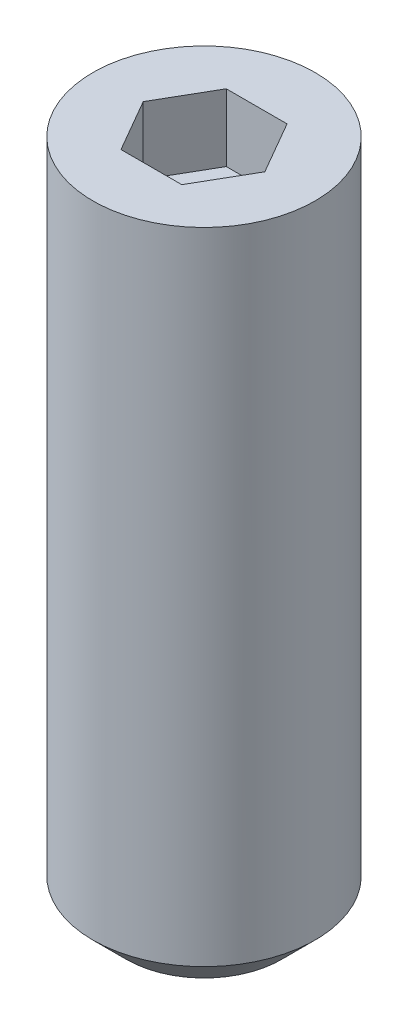
ISO-10303-21;
HEADER;
FILE_DESCRIPTION(('STEP AP214'),'2;1');
FILE_NAME('part.step','',(''),(''),'','','');
FILE_SCHEMA(('AUTOMOTIVE_DESIGN { 1 0 10303 214 1 1 1 1 }'));
ENDSEC;
DATA;
#1=APPLICATION_CONTEXT('core data for automotive mechanical design processes');
#2=APPLICATION_PROTOCOL_DEFINITION('international standard','automotive_design',2000,#1);
#3=PRODUCT_CONTEXT('',#1,'mechanical');
#4=PRODUCT('Part','Part','',(#3));
#5=PRODUCT_RELATED_PRODUCT_CATEGORY('part','',(#4));
#6=PRODUCT_DEFINITION_FORMATION('','',#4);
#7=PRODUCT_DEFINITION_CONTEXT('part definition',#1,'design');
#8=PRODUCT_DEFINITION('design','',#6,#7);
#9=PRODUCT_DEFINITION_SHAPE('','',#8);
#10=(LENGTH_UNIT() NAMED_UNIT(*) SI_UNIT(.MILLI.,.METRE.));
#11=(NAMED_UNIT(*) PLANE_ANGLE_UNIT() SI_UNIT($,.RADIAN.));
#12=(NAMED_UNIT(*) SI_UNIT($,.STERADIAN.) SOLID_ANGLE_UNIT());
#13=UNCERTAINTY_MEASURE_WITH_UNIT(LENGTH_MEASURE(1.E-05),#10,'distance_accuracy_value','');
#14=(GEOMETRIC_REPRESENTATION_CONTEXT(3) GLOBAL_UNCERTAINTY_ASSIGNED_CONTEXT((#13)) GLOBAL_UNIT_ASSIGNED_CONTEXT((#10,
#11,#12)) REPRESENTATION_CONTEXT('',''));
#15=CARTESIAN_POINT('',(0.,0.,0.));
#16=DIRECTION('',(0.,0.,1.));
#17=DIRECTION('',(1.,0.,0.));
#18=AXIS2_PLACEMENT_3D('',#15,#16,#17);
#19=CARTESIAN_POINT('',(-1.14567944042316,5.08,0.));
#20=DIRECTION('',(0.,1.,0.));
#21=DIRECTION('',(0.,0.,1.));
#22=AXIS2_PLACEMENT_3D('',#19,#20,#21);
#23=PLANE('',#22);
#24=DIRECTION('',(-0.5,0.,-0.866025403784438));
#25=VECTOR('',#24,1.);
#26=CARTESIAN_POINT('',(1.14567944042316,5.08,0.));
#27=LINE('',#26,#25);
#28=CARTESIAN_POINT('',(1.14567944042316,5.08,0.));
#29=VERTEX_POINT('',#28);
#30=CARTESIAN_POINT('',(0.572839720211582,5.08,-0.992187499999999));
#31=VERTEX_POINT('',#30);
#32=EDGE_CURVE('E67',#29,#31,#27,.T.);
#33=ORIENTED_EDGE('',*,*,#32,.T.);
#34=DIRECTION('',(-1.,0.,0.));
#35=VECTOR('',#34,1.);
#36=CARTESIAN_POINT('',(0.572839720211582,5.08,-0.992187499999999));
#37=LINE('',#36,#35);
#38=CARTESIAN_POINT('',(-0.572839720211583,5.08,-0.992187499999999));
#39=VERTEX_POINT('',#38);
#40=EDGE_CURVE('E69',#31,#39,#37,.T.);
#41=ORIENTED_EDGE('',*,*,#40,.T.);
#42=DIRECTION('',(-0.5,0.,0.866025403784439));
#43=VECTOR('',#42,1.);
#44=CARTESIAN_POINT('',(-0.572839720211583,5.08,-0.992187499999999));
#45=LINE('',#44,#43);
#46=CARTESIAN_POINT('',(-1.14567944042316,5.08,0.));
#47=VERTEX_POINT('',#46);
#48=EDGE_CURVE('E71',#39,#47,#45,.T.);
#49=ORIENTED_EDGE('',*,*,#48,.T.);
#50=DIRECTION('',(0.500000000000001,0.,0.866025403784438));
#51=VECTOR('',#50,1.);
#52=CARTESIAN_POINT('',(-1.14567944042316,5.08,0.));
#53=LINE('',#52,#51);
#54=CARTESIAN_POINT('',(-0.572839720211581,5.08,0.9921875));
#55=VERTEX_POINT('',#54);
#56=EDGE_CURVE('E117',#47,#55,#53,.T.);
#57=ORIENTED_EDGE('',*,*,#56,.T.);
#58=DIRECTION('',(1.,0.,0.));
#59=VECTOR('',#58,1.);
#60=CARTESIAN_POINT('',(-0.572839720211581,5.08,0.9921875));
#61=LINE('',#60,#59);
#62=CARTESIAN_POINT('',(0.572839720211582,5.08,0.9921875));
#63=VERTEX_POINT('',#62);
#64=EDGE_CURVE('E122',#55,#63,#61,.T.);
#65=ORIENTED_EDGE('',*,*,#64,.T.);
#66=DIRECTION('',(0.5,0.,-0.866025403784439));
#67=VECTOR('',#66,1.);
#68=CARTESIAN_POINT('',(0.572839720211582,5.08,0.9921875));
#69=LINE('',#68,#67);
#70=EDGE_CURVE('E126',#63,#29,#69,.T.);
#71=ORIENTED_EDGE('',*,*,#70,.T.);
#72=EDGE_LOOP('',(#33,#41,#49,#57,#65,#71));
#73=FACE_BOUND('',#72,.T.);
#74=ADVANCED_FACE('F16',(#73),#23,.T.);
#75=CARTESIAN_POINT('',(-0.572839720211583,5.08,-0.992187499999999));
#76=DIRECTION('',(-0.866025403784439,0.,-0.5));
#77=DIRECTION('',(-0.5,0.,0.866025403784439));
#78=AXIS2_PLACEMENT_3D('',#75,#76,#77);
#79=PLANE('',#78);
#80=DIRECTION('',(0.,1.,0.));
#81=VECTOR('',#80,1.);
#82=CARTESIAN_POINT('',(-1.14567944042316,5.08,0.));
#83=LINE('',#82,#81);
#84=CARTESIAN_POINT('',(-1.14567944042316,6.35,0.));
#85=VERTEX_POINT('',#84);
#86=EDGE_CURVE('E82',#85,#47,#83,.F.);
#87=ORIENTED_EDGE('',*,*,#86,.T.);
#88=ORIENTED_EDGE('',*,*,#48,.F.);
#89=DIRECTION('',(0.,1.,0.));
#90=VECTOR('',#89,1.);
#91=CARTESIAN_POINT('',(-0.572839720211583,5.08,-0.992187499999999));
#92=LINE('',#91,#90);
#93=CARTESIAN_POINT('',(-0.572839720211583,6.35,-0.992187499999999));
#94=VERTEX_POINT('',#93);
#95=EDGE_CURVE('E76',#39,#94,#92,.T.);
#96=ORIENTED_EDGE('',*,*,#95,.T.);
#97=DIRECTION('',(0.5,0.,-0.866025403784439));
#98=VECTOR('',#97,1.);
#99=CARTESIAN_POINT('',(-1.14567944042316,6.35,0.));
#100=LINE('',#99,#98);
#101=EDGE_CURVE('E114',#85,#94,#100,.T.);
#102=ORIENTED_EDGE('',*,*,#101,.F.);
#103=EDGE_LOOP('',(#87,#88,#96,#102));
#104=FACE_BOUND('',#103,.T.);
#105=ADVANCED_FACE('F79',(#104),#79,.F.);
#106=CARTESIAN_POINT('',(0.572839720211582,5.08,-0.992187499999999));
#107=DIRECTION('',(0.,0.,-1.));
#108=DIRECTION('',(-1.,0.,0.));
#109=AXIS2_PLACEMENT_3D('',#106,#107,#108);
#110=PLANE('',#109);
#111=ORIENTED_EDGE('',*,*,#95,.F.);
#112=ORIENTED_EDGE('',*,*,#40,.F.);
#113=DIRECTION('',(0.,1.,0.));
#114=VECTOR('',#113,1.);
#115=CARTESIAN_POINT('',(0.572839720211582,5.08,-0.992187499999999));
#116=LINE('',#115,#114);
#117=CARTESIAN_POINT('',(0.572839720211582,6.35,-0.992187499999999));
#118=VERTEX_POINT('',#117);
#119=EDGE_CURVE('E90',#31,#118,#116,.T.);
#120=ORIENTED_EDGE('',*,*,#119,.T.);
#121=DIRECTION('',(1.,0.,0.));
#122=VECTOR('',#121,1.);
#123=CARTESIAN_POINT('',(0.,6.35,-0.992187499999999));
#124=LINE('',#123,#122);
#125=EDGE_CURVE('E87',#94,#118,#124,.T.);
#126=ORIENTED_EDGE('',*,*,#125,.F.);
#127=EDGE_LOOP('',(#111,#112,#120,#126));
#128=FACE_BOUND('',#127,.T.);
#129=ADVANCED_FACE('F85',(#128),#110,.F.);
#130=CARTESIAN_POINT('',(1.14567944042316,5.08,0.));
#131=DIRECTION('',(0.866025403784438,0.,-0.5));
#132=DIRECTION('',(-0.5,0.,-0.866025403784438));
#133=AXIS2_PLACEMENT_3D('',#130,#131,#132);
#134=PLANE('',#133);
#135=ORIENTED_EDGE('',*,*,#119,.F.);
#136=ORIENTED_EDGE('',*,*,#32,.F.);
#137=DIRECTION('',(0.,1.,0.));
#138=VECTOR('',#137,1.);
#139=CARTESIAN_POINT('',(1.14567944042316,5.08,0.));
#140=LINE('',#139,#138);
#141=CARTESIAN_POINT('',(1.14567944042316,6.35,0.));
#142=VERTEX_POINT('',#141);
#143=EDGE_CURVE('E124',#29,#142,#140,.T.);
#144=ORIENTED_EDGE('',*,*,#143,.T.);
#145=DIRECTION('',(0.5,0.,0.866025403784438));
#146=VECTOR('',#145,1.);
#147=CARTESIAN_POINT('',(0.572839720211582,6.35,-0.992187499999999));
#148=LINE('',#147,#146);
#149=EDGE_CURVE('E110',#118,#142,#148,.T.);
#150=ORIENTED_EDGE('',*,*,#149,.F.);
#151=EDGE_LOOP('',(#135,#136,#144,#150));
#152=FACE_BOUND('',#151,.T.);
#153=ADVANCED_FACE('F129',(#152),#134,.F.);
#154=CARTESIAN_POINT('',(0.572839720211582,5.08,0.9921875));
#155=DIRECTION('',(0.866025403784439,0.,0.5));
#156=DIRECTION('',(0.5,0.,-0.866025403784439));
#157=AXIS2_PLACEMENT_3D('',#154,#155,#156);
#158=PLANE('',#157);
#159=ORIENTED_EDGE('',*,*,#143,.F.);
#160=ORIENTED_EDGE('',*,*,#70,.F.);
#161=DIRECTION('',(0.,1.,0.));
#162=VECTOR('',#161,1.);
#163=CARTESIAN_POINT('',(0.572839720211582,5.08,0.9921875));
#164=LINE('',#163,#162);
#165=CARTESIAN_POINT('',(0.572839720211582,6.35,0.9921875));
#166=VERTEX_POINT('',#165);
#167=EDGE_CURVE('E120',#63,#166,#164,.T.);
#168=ORIENTED_EDGE('',*,*,#167,.T.);
#169=DIRECTION('',(-0.5,0.,0.866025403784438));
#170=VECTOR('',#169,1.);
#171=CARTESIAN_POINT('',(1.14567944042316,6.35,0.));
#172=LINE('',#171,#170);
#173=EDGE_CURVE('E105',#142,#166,#172,.T.);
#174=ORIENTED_EDGE('',*,*,#173,.F.);
#175=EDGE_LOOP('',(#159,#160,#168,#174));
#176=FACE_BOUND('',#175,.T.);
#177=ADVANCED_FACE('F139',(#176),#158,.F.);
#178=CARTESIAN_POINT('',(-0.572839720211581,5.08,0.9921875));
#179=DIRECTION('',(0.,0.,1.));
#180=DIRECTION('',(1.,0.,0.));
#181=AXIS2_PLACEMENT_3D('',#178,#179,#180);
#182=PLANE('',#181);
#183=ORIENTED_EDGE('',*,*,#167,.F.);
#184=ORIENTED_EDGE('',*,*,#64,.F.);
#185=DIRECTION('',(0.,1.,0.));
#186=VECTOR('',#185,1.);
#187=CARTESIAN_POINT('',(-0.572839720211581,5.08,0.9921875));
#188=LINE('',#187,#186);
#189=CARTESIAN_POINT('',(-0.572839720211581,6.35,0.9921875));
#190=VERTEX_POINT('',#189);
#191=EDGE_CURVE('E34',#55,#190,#188,.T.);
#192=ORIENTED_EDGE('',*,*,#191,.T.);
#193=DIRECTION('',(1.,0.,0.));
#194=VECTOR('',#193,1.);
#195=CARTESIAN_POINT('',(0.,6.35,0.9921875));
#196=LINE('',#195,#194);
#197=EDGE_CURVE('E101',#166,#190,#196,.F.);
#198=ORIENTED_EDGE('',*,*,#197,.F.);
#199=EDGE_LOOP('',(#183,#184,#192,#198));
#200=FACE_BOUND('',#199,.T.);
#201=ADVANCED_FACE('F137',(#200),#182,.F.);
#202=CARTESIAN_POINT('',(-1.14567944042316,5.08,0.));
#203=DIRECTION('',(-0.866025403784438,0.,0.500000000000001));
#204=DIRECTION('',(0.500000000000001,0.,0.866025403784438));
#205=AXIS2_PLACEMENT_3D('',#202,#203,#204);
#206=PLANE('',#205);
#207=ORIENTED_EDGE('',*,*,#191,.F.);
#208=ORIENTED_EDGE('',*,*,#56,.F.);
#209=ORIENTED_EDGE('',*,*,#86,.F.);
#210=DIRECTION('',(-0.5,0.,-0.866025403784438));
#211=VECTOR('',#210,1.);
#212=CARTESIAN_POINT('',(-0.572839720211581,6.35,0.9921875));
#213=LINE('',#212,#211);
#214=EDGE_CURVE('E97',#190,#85,#213,.T.);
#215=ORIENTED_EDGE('',*,*,#214,.F.);
#216=EDGE_LOOP('',(#207,#208,#209,#215));
#217=FACE_BOUND('',#216,.T.);
#218=ADVANCED_FACE('F134',(#217),#206,.F.);
#219=CARTESIAN_POINT('',(0.,-6.35,0.));
#220=DIRECTION('',(0.,1.,0.));
#221=DIRECTION('',(0.,0.,1.));
#222=AXIS2_PLACEMENT_3D('',#219,#220,#221);
#223=PLANE('',#222);
#224=CARTESIAN_POINT('',(0.,-6.34999999994079,0.));
#225=DIRECTION('',(0.,1.,0.));
#226=DIRECTION('',(0.,0.,1.));
#227=AXIS2_PLACEMENT_3D('',#224,#225,#226);
#228=CIRCLE('',#227,1.46050000000741);
#229=CARTESIAN_POINT('',(0.,-6.34999999994079,1.46050000000741));
#230=VERTEX_POINT('',#229);
#231=EDGE_CURVE('E19',#230,#230,#228,.T.);
#232=ORIENTED_EDGE('',*,*,#231,.F.);
#233=EDGE_LOOP('',(#232));
#234=FACE_BOUND('',#233,.T.);
#235=ADVANCED_FACE('F162',(#234),#223,.F.);
#236=CARTESIAN_POINT('',(0.,6.35,0.));
#237=DIRECTION('',(0.,1.,0.));
#238=DIRECTION('',(0.,0.,1.));
#239=AXIS2_PLACEMENT_3D('',#236,#237,#238);
#240=PLANE('',#239);
#241=CARTESIAN_POINT('',(0.,6.35,0.));
#242=DIRECTION('',(0.,-1.,0.));
#243=DIRECTION('',(0.,0.,-1.));
#244=AXIS2_PLACEMENT_3D('',#241,#242,#243);
#245=CIRCLE('',#244,2.0955);
#246=CARTESIAN_POINT('',(0.,6.35,-2.0955));
#247=VERTEX_POINT('',#246);
#248=EDGE_CURVE('E25',#247,#247,#245,.T.);
#249=ORIENTED_EDGE('',*,*,#248,.F.);
#250=EDGE_LOOP('',(#249));
#251=FACE_BOUND('',#250,.T.);
#252=ORIENTED_EDGE('',*,*,#197,.T.);
#253=ORIENTED_EDGE('',*,*,#214,.T.);
#254=ORIENTED_EDGE('',*,*,#101,.T.);
#255=ORIENTED_EDGE('',*,*,#125,.T.);
#256=ORIENTED_EDGE('',*,*,#149,.T.);
#257=ORIENTED_EDGE('',*,*,#173,.T.);
#258=EDGE_LOOP('',(#252,#253,#254,#255,#256,#257));
#259=FACE_BOUND('',#258,.T.);
#260=ADVANCED_FACE('F132',(#251,#259),#240,.T.);
#261=CARTESIAN_POINT('',(0.,-5.71500000000924,0.));
#262=DIRECTION('',(0.,1.,0.));
#263=DIRECTION('',(0.,0.,1.));
#264=AXIS2_PLACEMENT_3D('',#261,#262,#263);
#265=CONICAL_SURFACE('',#264,2.09549999993897,0.785398163397448);
#266=CARTESIAN_POINT('',(0.,-5.715,0.));
#267=DIRECTION('',(0.,-1.,0.));
#268=DIRECTION('',(0.,0.,-1.));
#269=AXIS2_PLACEMENT_3D('',#266,#267,#268);
#270=CIRCLE('',#269,2.0955);
#271=CARTESIAN_POINT('',(0.,-5.715,-2.0955));
#272=VERTEX_POINT('',#271);
#273=EDGE_CURVE('E10',#272,#272,#270,.F.);
#274=ORIENTED_EDGE('',*,*,#273,.F.);
#275=EDGE_LOOP('',(#274));
#276=FACE_BOUND('',#275,.T.);
#277=ORIENTED_EDGE('',*,*,#231,.T.);
#278=EDGE_LOOP('',(#277));
#279=FACE_BOUND('',#278,.T.);
#280=ADVANCED_FACE('F151',(#276,#279),#265,.T.);
#281=CARTESIAN_POINT('',(0.,6.35,0.));
#282=DIRECTION('',(0.,-1.,0.));
#283=DIRECTION('',(0.,0.,-1.));
#284=AXIS2_PLACEMENT_3D('',#281,#282,#283);
#285=CYLINDRICAL_SURFACE('',#284,2.0955);
#286=ORIENTED_EDGE('',*,*,#273,.T.);
#287=EDGE_LOOP('',(#286));
#288=FACE_BOUND('',#287,.T.);
#289=ORIENTED_EDGE('',*,*,#248,.T.);
#290=EDGE_LOOP('',(#289));
#291=FACE_BOUND('',#290,.T.);
#292=ADVANCED_FACE('F149',(#288,#291),#285,.T.);
#293=CLOSED_SHELL('',(#74,#105,#129,#153,#177,#201,#218,#235,#260,#280,#292));
#294=MANIFOLD_SOLID_BREP('B1',#293);
#295=ADVANCED_BREP_SHAPE_REPRESENTATION('',(#18,#294),#14);
#296=SHAPE_DEFINITION_REPRESENTATION(#9,#295);
ENDSEC;
END-ISO-10303-21;
